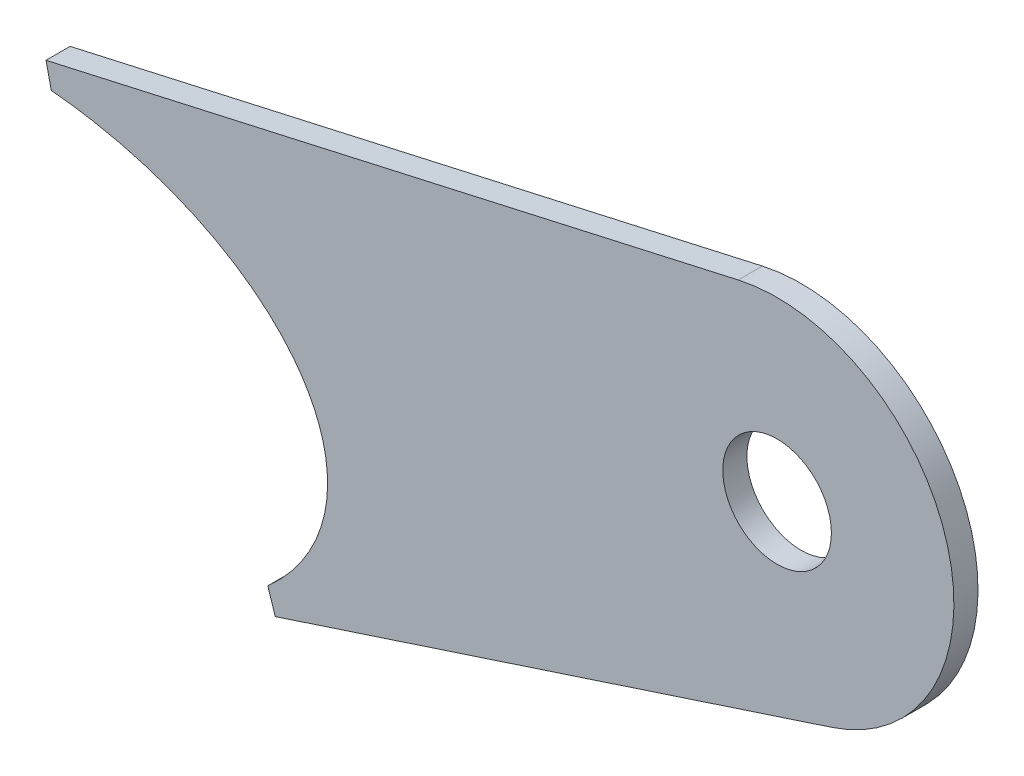
ISO-10303-21;
HEADER;
FILE_DESCRIPTION(('STEP AP214'),'2;1');
FILE_NAME('part.step','',(''),(''),'','','');
FILE_SCHEMA(('AUTOMOTIVE_DESIGN { 1 0 10303 214 1 1 1 1 }'));
ENDSEC;
DATA;
#1=APPLICATION_CONTEXT('core data for automotive mechanical design processes');
#2=APPLICATION_PROTOCOL_DEFINITION('international standard','automotive_design',2000,#1);
#3=PRODUCT_CONTEXT('',#1,'mechanical');
#4=PRODUCT('Part','Part','',(#3));
#5=PRODUCT_RELATED_PRODUCT_CATEGORY('part','',(#4));
#6=PRODUCT_DEFINITION_FORMATION('','',#4);
#7=PRODUCT_DEFINITION_CONTEXT('part definition',#1,'design');
#8=PRODUCT_DEFINITION('design','',#6,#7);
#9=PRODUCT_DEFINITION_SHAPE('','',#8);
#10=(LENGTH_UNIT() NAMED_UNIT(*) SI_UNIT(.MILLI.,.METRE.));
#11=(NAMED_UNIT(*) PLANE_ANGLE_UNIT() SI_UNIT($,.RADIAN.));
#12=(NAMED_UNIT(*) SI_UNIT($,.STERADIAN.) SOLID_ANGLE_UNIT());
#13=UNCERTAINTY_MEASURE_WITH_UNIT(LENGTH_MEASURE(1.E-05),#10,'distance_accuracy_value','');
#14=(GEOMETRIC_REPRESENTATION_CONTEXT(3) GLOBAL_UNCERTAINTY_ASSIGNED_CONTEXT((#13)) GLOBAL_UNIT_ASSIGNED_CONTEXT((#10,
#11,#12)) REPRESENTATION_CONTEXT('',''));
#15=CARTESIAN_POINT('',(0.,0.,0.));
#16=DIRECTION('',(0.,0.,1.));
#17=DIRECTION('',(1.,0.,0.));
#18=AXIS2_PLACEMENT_3D('',#15,#16,#17);
#19=CARTESIAN_POINT('',(-250.470260929668,-2.,16.5));
#20=DIRECTION('',(0.,0.,1.));
#21=DIRECTION('',(1.,0.,0.));
#22=AXIS2_PLACEMENT_3D('',#19,#20,#21);
#23=ELLIPSE('',#22,20.0103067330089,12.7);
#24=DIRECTION('',(0.,0.,1.));
#25=VECTOR('',#24,1.);
#26=SURFACE_OF_LINEAR_EXTRUSION('',#23,#25);
#27=CARTESIAN_POINT('',(-250.470260929668,-2.,18.));
#28=DIRECTION('',(0.,0.,1.));
#29=DIRECTION('',(1.,0.,0.));
#30=AXIS2_PLACEMENT_3D('',#27,#28,#29);
#31=ELLIPSE('',#30,20.0103067330089,12.7);
#32=CARTESIAN_POINT('',(-234.182299449252,-9.37736470795605,18.));
#33=VERTEX_POINT('',#32);
#34=CARTESIAN_POINT('',(-247.648585214445,10.573101758167,18.));
#35=VERTEX_POINT('',#34);
#36=EDGE_CURVE('E123',#33,#35,#31,.T.);
#37=ORIENTED_EDGE('',*,*,#36,.T.);
#38=DIRECTION('',(0.,0.,1.));
#39=VECTOR('',#38,1.);
#40=CARTESIAN_POINT('',(-247.648585214445,10.573101758167,16.5));
#41=LINE('',#40,#39);
#42=CARTESIAN_POINT('',(-247.648585214445,10.573101758167,16.5));
#43=VERTEX_POINT('',#42);
#44=EDGE_CURVE('E11',#43,#35,#41,.T.);
#45=ORIENTED_EDGE('',*,*,#44,.F.);
#46=CARTESIAN_POINT('',(-234.182299449252,-9.37736470795605,16.5));
#47=VERTEX_POINT('',#46);
#48=EDGE_CURVE('E55',#47,#43,#23,.T.);
#49=ORIENTED_EDGE('',*,*,#48,.F.);
#50=DIRECTION('',(0.,0.,1.));
#51=VECTOR('',#50,1.);
#52=CARTESIAN_POINT('',(-234.182299449252,-9.37736470795605,16.5));
#53=LINE('',#52,#51);
#54=EDGE_CURVE('E40',#47,#33,#53,.T.);
#55=ORIENTED_EDGE('',*,*,#54,.T.);
#56=EDGE_LOOP('',(#37,#45,#49,#55));
#57=FACE_BOUND('',#56,.T.);
#58=ADVANCED_FACE('F36',(#57),#26,.F.);
#59=CARTESIAN_POINT('',(-233.43591969779,-52.5554258025155,16.5));
#60=DIRECTION('',(-0.975580799362543,-0.219640852108941,0.));
#61=DIRECTION('',(0.219640852108941,-0.975580799362543,0.));
#62=AXIS2_PLACEMENT_3D('',#59,#60,#61);
#63=PLANE('',#62);
#64=DIRECTION('',(0.219640852108941,-0.975580799362543,0.));
#65=VECTOR('',#64,1.);
#66=CARTESIAN_POINT('',(-233.43591969779,-52.5554258025155,18.));
#67=LINE('',#66,#65);
#68=CARTESIAN_POINT('',(-247.978046492608,12.0364729572108,18.));
#69=VERTEX_POINT('',#68);
#70=EDGE_CURVE('E132',#69,#35,#67,.T.);
#71=ORIENTED_EDGE('',*,*,#70,.F.);
#72=DIRECTION('',(0.,0.,1.));
#73=VECTOR('',#72,1.);
#74=CARTESIAN_POINT('',(-247.978046492608,12.0364729572108,16.5));
#75=LINE('',#74,#73);
#76=CARTESIAN_POINT('',(-247.978046492608,12.0364729572108,16.5));
#77=VERTEX_POINT('',#76);
#78=EDGE_CURVE('E46',#77,#69,#75,.T.);
#79=ORIENTED_EDGE('',*,*,#78,.F.);
#80=DIRECTION('',(0.219640852108941,-0.975580799362543,0.));
#81=VECTOR('',#80,1.);
#82=CARTESIAN_POINT('',(-233.43591969779,-52.5554258025155,16.5));
#83=LINE('',#82,#81);
#84=EDGE_CURVE('E110',#77,#43,#83,.T.);
#85=ORIENTED_EDGE('',*,*,#84,.T.);
#86=ORIENTED_EDGE('',*,*,#44,.T.);
#87=EDGE_LOOP('',(#71,#79,#85,#86));
#88=FACE_BOUND('',#87,.T.);
#89=ADVANCED_FACE('F151',(#88),#63,.T.);
#90=CARTESIAN_POINT('',(-14.5421267948189,64.5918987597265,16.5));
#91=DIRECTION('',(-0.219640852108942,0.975580799362543,0.));
#92=DIRECTION('',(-0.975580799362543,-0.219640852108942,0.));
#93=AXIS2_PLACEMENT_3D('',#90,#91,#92);
#94=PLANE('',#93);
#95=DIRECTION('',(-0.975580799362543,-0.219640852108942,0.));
#96=VECTOR('',#95,1.);
#97=CARTESIAN_POINT('',(-14.5421267948189,64.5918987597265,18.));
#98=LINE('',#97,#96);
#99=CARTESIAN_POINT('',(-204.916049373198,21.731388792988,18.));
#100=VERTEX_POINT('',#99);
#101=EDGE_CURVE('E99',#100,#69,#98,.T.);
#102=ORIENTED_EDGE('',*,*,#101,.F.);
#103=DIRECTION('',(0.,0.,1.));
#104=VECTOR('',#103,1.);
#105=CARTESIAN_POINT('',(-204.916049373198,21.731388792988,16.5));
#106=LINE('',#105,#104);
#107=CARTESIAN_POINT('',(-204.916049373198,21.731388792988,16.5));
#108=VERTEX_POINT('',#107);
#109=EDGE_CURVE('E95',#108,#100,#106,.T.);
#110=ORIENTED_EDGE('',*,*,#109,.F.);
#111=DIRECTION('',(-0.975580799362543,-0.219640852108942,0.));
#112=VECTOR('',#111,1.);
#113=CARTESIAN_POINT('',(-14.5421267948189,64.5918987597265,16.5));
#114=LINE('',#113,#112);
#115=EDGE_CURVE('E98',#108,#77,#114,.T.);
#116=ORIENTED_EDGE('',*,*,#115,.T.);
#117=ORIENTED_EDGE('',*,*,#78,.T.);
#118=EDGE_LOOP('',(#102,#110,#116,#117));
#119=FACE_BOUND('',#118,.T.);
#120=ADVANCED_FACE('F97',(#119),#94,.T.);
#121=CARTESIAN_POINT('',(-202.5,11.,16.5));
#122=DIRECTION('',(0.,0.,1.));
#123=DIRECTION('',(1.,0.,0.));
#124=AXIS2_PLACEMENT_3D('',#121,#122,#123);
#125=CYLINDRICAL_SURFACE('',#124,11.);
#126=CARTESIAN_POINT('',(-202.5,11.,18.));
#127=DIRECTION('',(0.,0.,1.));
#128=DIRECTION('',(1.,0.,0.));
#129=AXIS2_PLACEMENT_3D('',#126,#127,#128);
#130=CIRCLE('',#129,11.);
#131=CARTESIAN_POINT('',(-199.07508398847,0.546773210440436,18.));
#132=VERTEX_POINT('',#131);
#133=EDGE_CURVE('E129',#132,#100,#130,.T.);
#134=ORIENTED_EDGE('',*,*,#133,.F.);
#135=DIRECTION('',(0.,0.,1.));
#136=VECTOR('',#135,1.);
#137=CARTESIAN_POINT('',(-199.07508398847,0.546773210440436,16.5));
#138=LINE('',#137,#136);
#139=CARTESIAN_POINT('',(-199.07508398847,0.546773210440436,16.5));
#140=VERTEX_POINT('',#139);
#141=EDGE_CURVE('E104',#140,#132,#138,.T.);
#142=ORIENTED_EDGE('',*,*,#141,.F.);
#143=CARTESIAN_POINT('',(-202.5,11.,16.5));
#144=DIRECTION('',(0.,0.,1.));
#145=DIRECTION('',(1.,0.,0.));
#146=AXIS2_PLACEMENT_3D('',#143,#144,#145);
#147=CIRCLE('',#146,11.);
#148=EDGE_CURVE('E109',#140,#108,#147,.T.);
#149=ORIENTED_EDGE('',*,*,#148,.T.);
#150=ORIENTED_EDGE('',*,*,#109,.T.);
#151=EDGE_LOOP('',(#134,#142,#149,#150));
#152=FACE_BOUND('',#151,.T.);
#153=ADVANCED_FACE('F112',(#152),#125,.T.);
#154=CARTESIAN_POINT('',(-19.4606271559319,59.396011009666,16.5));
#155=DIRECTION('',(-0.311356001048182,0.950293344505413,0.));
#156=DIRECTION('',(-0.950293344505413,-0.311356001048182,0.));
#157=AXIS2_PLACEMENT_3D('',#154,#155,#156);
#158=PLANE('',#157);
#159=DIRECTION('',(-0.950293344505413,-0.311356001048182,0.));
#160=VECTOR('',#159,1.);
#161=CARTESIAN_POINT('',(-19.4606271559319,59.396011009666,18.));
#162=LINE('',#161,#160);
#163=CARTESIAN_POINT('',(-233.71526544768,-10.8028047247143,18.));
#164=VERTEX_POINT('',#163);
#165=EDGE_CURVE('E127',#132,#164,#162,.T.);
#166=ORIENTED_EDGE('',*,*,#165,.T.);
#167=DIRECTION('',(0.,0.,1.));
#168=VECTOR('',#167,1.);
#169=CARTESIAN_POINT('',(-233.71526544768,-10.8028047247143,16.5));
#170=LINE('',#169,#168);
#171=CARTESIAN_POINT('',(-233.71526544768,-10.8028047247143,16.5));
#172=VERTEX_POINT('',#171);
#173=EDGE_CURVE('E139',#172,#164,#170,.T.);
#174=ORIENTED_EDGE('',*,*,#173,.F.);
#175=DIRECTION('',(-0.950293344505413,-0.311356001048182,0.));
#176=VECTOR('',#175,1.);
#177=CARTESIAN_POINT('',(-19.4606271559319,59.396011009666,16.5));
#178=LINE('',#177,#176);
#179=EDGE_CURVE('E114',#140,#172,#178,.T.);
#180=ORIENTED_EDGE('',*,*,#179,.F.);
#181=ORIENTED_EDGE('',*,*,#141,.T.);
#182=EDGE_LOOP('',(#166,#174,#180,#181));
#183=FACE_BOUND('',#182,.T.);
#184=ADVANCED_FACE('F165',(#183),#158,.F.);
#185=CARTESIAN_POINT('',(-214.254638291752,-70.1988157343747,16.5));
#186=DIRECTION('',(0.950293344505422,0.311356001048155,0.));
#187=DIRECTION('',(-0.311356001048155,0.950293344505422,0.));
#188=AXIS2_PLACEMENT_3D('',#185,#186,#187);
#189=PLANE('',#188);
#190=DIRECTION('',(-0.311356001048155,0.950293344505422,0.));
#191=VECTOR('',#190,1.);
#192=CARTESIAN_POINT('',(-214.254638291752,-70.1988157343747,18.));
#193=LINE('',#192,#191);
#194=EDGE_CURVE('E125',#164,#33,#193,.T.);
#195=ORIENTED_EDGE('',*,*,#194,.T.);
#196=ORIENTED_EDGE('',*,*,#54,.F.);
#197=DIRECTION('',(-0.311356001048155,0.950293344505422,0.));
#198=VECTOR('',#197,1.);
#199=CARTESIAN_POINT('',(-214.254638291752,-70.1988157343747,16.5));
#200=LINE('',#199,#198);
#201=EDGE_CURVE('E88',#172,#47,#200,.T.);
#202=ORIENTED_EDGE('',*,*,#201,.F.);
#203=ORIENTED_EDGE('',*,*,#173,.T.);
#204=EDGE_LOOP('',(#195,#196,#202,#203));
#205=FACE_BOUND('',#204,.T.);
#206=ADVANCED_FACE('F167',(#205),#189,.F.);
#207=CARTESIAN_POINT('',(-202.5,11.,16.5));
#208=DIRECTION('',(0.,0.,1.));
#209=DIRECTION('',(1.,0.,0.));
#210=AXIS2_PLACEMENT_3D('',#207,#208,#209);
#211=CYLINDRICAL_SURFACE('',#210,3.37819999999999);
#212=CARTESIAN_POINT('',(-202.5,11.,16.5));
#213=DIRECTION('',(0.,0.,1.));
#214=DIRECTION('',(1.,0.,0.));
#215=AXIS2_PLACEMENT_3D('',#212,#213,#214);
#216=CIRCLE('',#215,3.37819999999999);
#217=CARTESIAN_POINT('',(-199.1218,11.,16.5));
#218=VERTEX_POINT('',#217);
#219=EDGE_CURVE('E120',#218,#218,#216,.T.);
#220=ORIENTED_EDGE('',*,*,#219,.F.);
#221=EDGE_LOOP('',(#220));
#222=FACE_BOUND('',#221,.T.);
#223=CARTESIAN_POINT('',(-202.5,11.,18.));
#224=DIRECTION('',(0.,0.,1.));
#225=DIRECTION('',(1.,0.,0.));
#226=AXIS2_PLACEMENT_3D('',#223,#224,#225);
#227=CIRCLE('',#226,3.37819999999999);
#228=CARTESIAN_POINT('',(-199.1218,11.,18.));
#229=VERTEX_POINT('',#228);
#230=EDGE_CURVE('E135',#229,#229,#227,.T.);
#231=ORIENTED_EDGE('',*,*,#230,.T.);
#232=EDGE_LOOP('',(#231));
#233=FACE_BOUND('',#232,.T.);
#234=ADVANCED_FACE('F160',(#222,#233),#211,.F.);
#235=CARTESIAN_POINT('',(0.,0.,16.5));
#236=DIRECTION('',(0.,0.,1.));
#237=DIRECTION('',(1.,0.,0.));
#238=AXIS2_PLACEMENT_3D('',#235,#236,#237);
#239=PLANE('',#238);
#240=ORIENTED_EDGE('',*,*,#48,.T.);
#241=ORIENTED_EDGE('',*,*,#84,.F.);
#242=ORIENTED_EDGE('',*,*,#115,.F.);
#243=ORIENTED_EDGE('',*,*,#148,.F.);
#244=ORIENTED_EDGE('',*,*,#179,.T.);
#245=ORIENTED_EDGE('',*,*,#201,.T.);
#246=EDGE_LOOP('',(#240,#241,#242,#243,#244,#245));
#247=FACE_BOUND('',#246,.T.);
#248=ORIENTED_EDGE('',*,*,#219,.T.);
#249=EDGE_LOOP('',(#248));
#250=FACE_BOUND('',#249,.T.);
#251=ADVANCED_FACE('F107',(#247,#250),#239,.F.);
#252=CARTESIAN_POINT('',(0.,0.,18.));
#253=DIRECTION('',(0.,0.,1.));
#254=DIRECTION('',(1.,0.,0.));
#255=AXIS2_PLACEMENT_3D('',#252,#253,#254);
#256=PLANE('',#255);
#257=ORIENTED_EDGE('',*,*,#36,.F.);
#258=ORIENTED_EDGE('',*,*,#194,.F.);
#259=ORIENTED_EDGE('',*,*,#165,.F.);
#260=ORIENTED_EDGE('',*,*,#133,.T.);
#261=ORIENTED_EDGE('',*,*,#101,.T.);
#262=ORIENTED_EDGE('',*,*,#70,.T.);
#263=EDGE_LOOP('',(#257,#258,#259,#260,#261,#262));
#264=FACE_BOUND('',#263,.T.);
#265=ORIENTED_EDGE('',*,*,#230,.F.);
#266=EDGE_LOOP('',(#265));
#267=FACE_BOUND('',#266,.T.);
#268=ADVANCED_FACE('F148',(#264,#267),#256,.T.);
#269=CLOSED_SHELL('',(#58,#89,#120,#153,#184,#206,#234,#251,#268));
#270=MANIFOLD_SOLID_BREP('B2',#269);
#271=ADVANCED_BREP_SHAPE_REPRESENTATION('',(#18,#270),#14);
#272=SHAPE_DEFINITION_REPRESENTATION(#9,#271);
ENDSEC;
END-ISO-10303-21;
